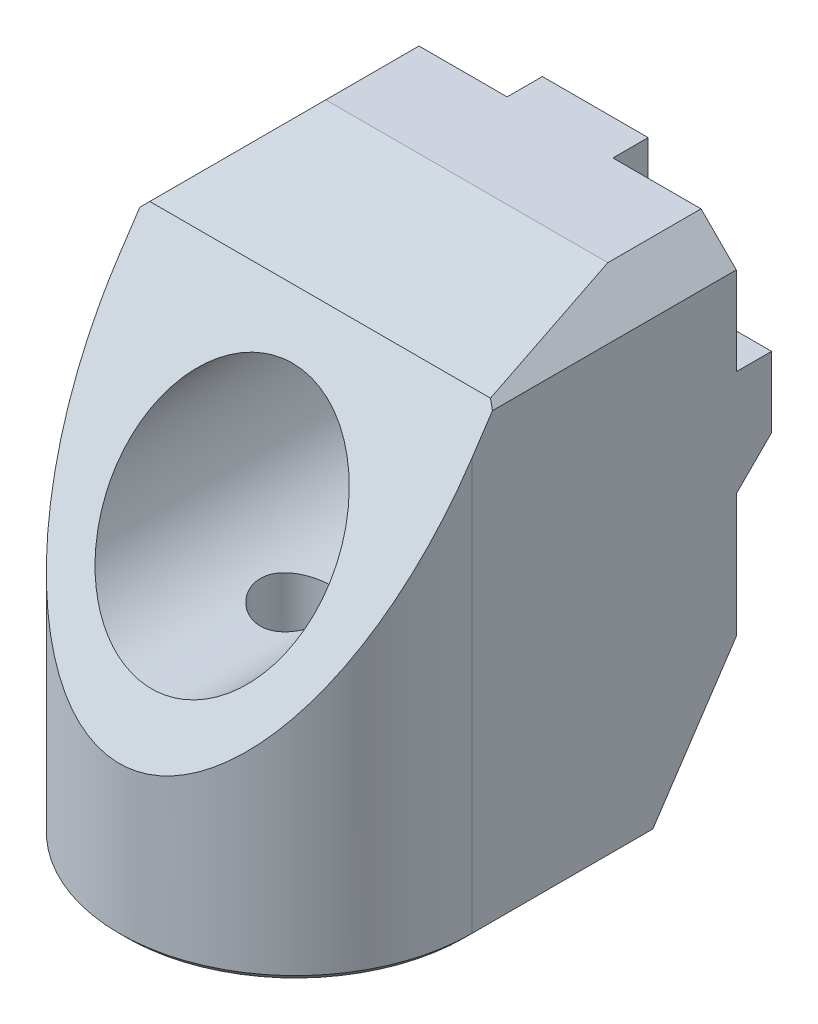
ISO-10303-21;
HEADER;
FILE_DESCRIPTION(('STEP AP214'),'2;1');
FILE_NAME('part.step','',(''),(''),'','','');
FILE_SCHEMA(('AUTOMOTIVE_DESIGN { 1 0 10303 214 1 1 1 1 }'));
ENDSEC;
DATA;
#1=APPLICATION_CONTEXT('core data for automotive mechanical design processes');
#2=APPLICATION_PROTOCOL_DEFINITION('international standard','automotive_design',2000,#1);
#3=PRODUCT_CONTEXT('',#1,'mechanical');
#4=PRODUCT('Part','Part','',(#3));
#5=PRODUCT_RELATED_PRODUCT_CATEGORY('part','',(#4));
#6=PRODUCT_DEFINITION_FORMATION('','',#4);
#7=PRODUCT_DEFINITION_CONTEXT('part definition',#1,'design');
#8=PRODUCT_DEFINITION('design','',#6,#7);
#9=PRODUCT_DEFINITION_SHAPE('','',#8);
#10=(LENGTH_UNIT() NAMED_UNIT(*) SI_UNIT(.MILLI.,.METRE.));
#11=(NAMED_UNIT(*) PLANE_ANGLE_UNIT() SI_UNIT($,.RADIAN.));
#12=(NAMED_UNIT(*) SI_UNIT($,.STERADIAN.) SOLID_ANGLE_UNIT());
#13=UNCERTAINTY_MEASURE_WITH_UNIT(LENGTH_MEASURE(1.E-05),#10,'distance_accuracy_value','');
#14=(GEOMETRIC_REPRESENTATION_CONTEXT(3) GLOBAL_UNCERTAINTY_ASSIGNED_CONTEXT((#13)) GLOBAL_UNIT_ASSIGNED_CONTEXT((#10,
#11,#12)) REPRESENTATION_CONTEXT('',''));
#15=CARTESIAN_POINT('',(0.,0.,0.));
#16=DIRECTION('',(0.,0.,1.));
#17=DIRECTION('',(1.,0.,0.));
#18=AXIS2_PLACEMENT_3D('',#15,#16,#17);
#19=CARTESIAN_POINT('',(0.,0.,0.));
#20=DIRECTION('',(0.,0.,1.));
#21=DIRECTION('',(1.,0.,0.));
#22=AXIS2_PLACEMENT_3D('',#19,#20,#21);
#23=PLANE('',#22);
#24=CARTESIAN_POINT('',(0.,0.,0.));
#25=DIRECTION('',(0.,0.,1.));
#26=DIRECTION('',(1.,0.,0.));
#27=AXIS2_PLACEMENT_3D('',#24,#25,#26);
#28=CIRCLE('',#27,2.75);
#29=CARTESIAN_POINT('',(2.75,0.,0.));
#30=VERTEX_POINT('',#29);
#31=EDGE_CURVE('E499',#30,#30,#28,.T.);
#32=ORIENTED_EDGE('',*,*,#31,.T.);
#33=EDGE_LOOP('',(#32));
#34=FACE_BOUND('',#33,.T.);
#35=DIRECTION('',(-1.,0.,0.));
#36=VECTOR('',#35,1.);
#37=CARTESIAN_POINT('',(10.,-3.00000000000022,0.));
#38=LINE('',#37,#36);
#39=CARTESIAN_POINT('',(10.,-3.00000000000022,0.));
#40=VERTEX_POINT('',#39);
#41=CARTESIAN_POINT('',(6.,-3.00000000000022,0.));
#42=VERTEX_POINT('',#41);
#43=EDGE_CURVE('E202',#40,#42,#38,.T.);
#44=ORIENTED_EDGE('',*,*,#43,.F.);
#45=DIRECTION('',(0.,1.,0.));
#46=VECTOR('',#45,1.);
#47=CARTESIAN_POINT('',(10.,10.,0.));
#48=LINE('',#47,#46);
#49=CARTESIAN_POINT('',(10.,-10.,0.));
#50=VERTEX_POINT('',#49);
#51=EDGE_CURVE('E493',#50,#40,#48,.T.);
#52=ORIENTED_EDGE('',*,*,#51,.F.);
#53=DIRECTION('',(1.,0.,0.));
#54=VECTOR('',#53,1.);
#55=CARTESIAN_POINT('',(-10.,-10.,0.));
#56=LINE('',#55,#54);
#57=CARTESIAN_POINT('',(-10.,-10.,0.));
#58=VERTEX_POINT('',#57);
#59=EDGE_CURVE('E507',#58,#50,#56,.T.);
#60=ORIENTED_EDGE('',*,*,#59,.F.);
#61=DIRECTION('',(0.,-1.,0.));
#62=VECTOR('',#61,1.);
#63=CARTESIAN_POINT('',(-10.,-10.,0.));
#64=LINE('',#63,#62);
#65=CARTESIAN_POINT('',(-10.,-3.00000000000001,0.));
#66=VERTEX_POINT('',#65);
#67=EDGE_CURVE('E498',#66,#58,#64,.T.);
#68=ORIENTED_EDGE('',*,*,#67,.F.);
#69=DIRECTION('',(-1.,0.,0.));
#70=VECTOR('',#69,1.);
#71=CARTESIAN_POINT('',(-10.0000000000002,-3.,0.));
#72=LINE('',#71,#70);
#73=CARTESIAN_POINT('',(-6.00000000000022,-3.,0.));
#74=VERTEX_POINT('',#73);
#75=EDGE_CURVE('E230',#74,#66,#72,.T.);
#76=ORIENTED_EDGE('',*,*,#75,.F.);
#77=DIRECTION('',(0.,-1.,0.));
#78=VECTOR('',#77,1.);
#79=CARTESIAN_POINT('',(-6.00000000000022,3.,0.));
#80=LINE('',#79,#78);
#81=CARTESIAN_POINT('',(-6.00000000000022,3.,0.));
#82=VERTEX_POINT('',#81);
#83=EDGE_CURVE('E233',#82,#74,#80,.T.);
#84=ORIENTED_EDGE('',*,*,#83,.F.);
#85=DIRECTION('',(1.,0.,0.));
#86=VECTOR('',#85,1.);
#87=CARTESIAN_POINT('',(-10.0000000000002,3.,0.));
#88=LINE('',#87,#86);
#89=CARTESIAN_POINT('',(-10.0000000000002,3.,0.));
#90=VERTEX_POINT('',#89);
#91=EDGE_CURVE('E236',#90,#82,#88,.T.);
#92=ORIENTED_EDGE('',*,*,#91,.F.);
#93=CARTESIAN_POINT('',(-10.,8.,0.));
#94=VERTEX_POINT('',#93);
#95=EDGE_CURVE('E495',#94,#90,#64,.T.);
#96=ORIENTED_EDGE('',*,*,#95,.F.);
#97=DIRECTION('',(-0.707106781186548,-0.707106781186547,0.));
#98=VECTOR('',#97,1.);
#99=CARTESIAN_POINT('',(-10.,8.,0.));
#100=LINE('',#99,#98);
#101=CARTESIAN_POINT('',(-8.00000000000001,10.,0.));
#102=VERTEX_POINT('',#101);
#103=EDGE_CURVE('E464',#94,#102,#100,.F.);
#104=ORIENTED_EDGE('',*,*,#103,.T.);
#105=DIRECTION('',(-1.,0.,0.));
#106=VECTOR('',#105,1.);
#107=CARTESIAN_POINT('',(-10.,10.,0.));
#108=LINE('',#107,#106);
#109=CARTESIAN_POINT('',(-3.,10.,0.));
#110=VERTEX_POINT('',#109);
#111=EDGE_CURVE('E492',#110,#102,#108,.T.);
#112=ORIENTED_EDGE('',*,*,#111,.F.);
#113=DIRECTION('',(0.,1.,0.));
#114=VECTOR('',#113,1.);
#115=CARTESIAN_POINT('',(-3.,10.,0.));
#116=LINE('',#115,#114);
#117=CARTESIAN_POINT('',(-3.,6.,0.));
#118=VERTEX_POINT('',#117);
#119=EDGE_CURVE('E248',#118,#110,#116,.T.);
#120=ORIENTED_EDGE('',*,*,#119,.F.);
#121=DIRECTION('',(-1.,0.,0.));
#122=VECTOR('',#121,1.);
#123=CARTESIAN_POINT('',(3.,6.,0.));
#124=LINE('',#123,#122);
#125=CARTESIAN_POINT('',(3.,6.,0.));
#126=VERTEX_POINT('',#125);
#127=EDGE_CURVE('E255',#126,#118,#124,.T.);
#128=ORIENTED_EDGE('',*,*,#127,.F.);
#129=DIRECTION('',(0.,-1.,0.));
#130=VECTOR('',#129,1.);
#131=CARTESIAN_POINT('',(3.,10.,0.));
#132=LINE('',#131,#130);
#133=CARTESIAN_POINT('',(3.,10.,0.));
#134=VERTEX_POINT('',#133);
#135=EDGE_CURVE('E238',#134,#126,#132,.T.);
#136=ORIENTED_EDGE('',*,*,#135,.F.);
#137=CARTESIAN_POINT('',(8.00000000000001,10.,0.));
#138=VERTEX_POINT('',#137);
#139=EDGE_CURVE('E489',#138,#134,#108,.T.);
#140=ORIENTED_EDGE('',*,*,#139,.F.);
#141=DIRECTION('',(-0.707106781186546,0.707106781186549,0.));
#142=VECTOR('',#141,1.);
#143=CARTESIAN_POINT('',(8.00000000000001,10.,0.));
#144=LINE('',#143,#142);
#145=CARTESIAN_POINT('',(10.,8.,0.));
#146=VERTEX_POINT('',#145);
#147=EDGE_CURVE('E462',#138,#146,#144,.F.);
#148=ORIENTED_EDGE('',*,*,#147,.T.);
#149=CARTESIAN_POINT('',(10.,2.99999999999978,0.));
#150=VERTEX_POINT('',#149);
#151=EDGE_CURVE('E214',#150,#146,#48,.T.);
#152=ORIENTED_EDGE('',*,*,#151,.F.);
#153=DIRECTION('',(1.,0.,0.));
#154=VECTOR('',#153,1.);
#155=CARTESIAN_POINT('',(10.,2.99999999999978,0.));
#156=LINE('',#155,#154);
#157=CARTESIAN_POINT('',(6.,2.99999999999978,0.));
#158=VERTEX_POINT('',#157);
#159=EDGE_CURVE('E203',#158,#150,#156,.T.);
#160=ORIENTED_EDGE('',*,*,#159,.F.);
#161=DIRECTION('',(0.,1.,0.));
#162=VECTOR('',#161,1.);
#163=CARTESIAN_POINT('',(6.,-3.00000000000022,0.));
#164=LINE('',#163,#162);
#165=EDGE_CURVE('E194',#42,#158,#164,.T.);
#166=ORIENTED_EDGE('',*,*,#165,.F.);
#167=EDGE_LOOP('',(#44,#52,#60,#68,#76,#84,#92,#96,#104,#112,#120,#128,#136,#140,#148,#152,#160,#166));
#168=FACE_BOUND('',#167,.T.);
#169=ADVANCED_FACE('F38',(#34,#168),#23,.F.);
#170=CARTESIAN_POINT('',(10.,10.,25.));
#171=DIRECTION('',(-1.,0.,0.));
#172=DIRECTION('',(0.,-1.,0.));
#173=AXIS2_PLACEMENT_3D('',#170,#171,#172);
#174=PLANE('',#173);
#175=ORIENTED_EDGE('',*,*,#51,.T.);
#176=DIRECTION('',(0.,-0.707106781186546,0.707106781186549));
#177=VECTOR('',#176,1.);
#178=CARTESIAN_POINT('',(10.,-1.00000000000022,-2.));
#179=LINE('',#178,#177);
#180=CARTESIAN_POINT('',(10.,-1.00000000000022,-2.));
#181=VERTEX_POINT('',#180);
#182=EDGE_CURVE('E11',#40,#181,#179,.F.);
#183=ORIENTED_EDGE('',*,*,#182,.T.);
#184=DIRECTION('',(0.,-1.,0.));
#185=VECTOR('',#184,1.);
#186=CARTESIAN_POINT('',(10.,-3.00000000000022,-2.));
#187=LINE('',#186,#185);
#188=CARTESIAN_POINT('',(10.,2.99999999999978,-2.));
#189=VERTEX_POINT('',#188);
#190=EDGE_CURVE('E215',#189,#181,#187,.T.);
#191=ORIENTED_EDGE('',*,*,#190,.F.);
#192=DIRECTION('',(0.,0.,1.));
#193=VECTOR('',#192,1.);
#194=CARTESIAN_POINT('',(10.,2.99999999999978,-2.));
#195=LINE('',#194,#193);
#196=EDGE_CURVE('E211',#189,#150,#195,.T.);
#197=ORIENTED_EDGE('',*,*,#196,.T.);
#198=ORIENTED_EDGE('',*,*,#151,.T.);
#199=DIRECTION('',(0.,0.,1.));
#200=VECTOR('',#199,1.);
#201=CARTESIAN_POINT('',(10.,8.,25.));
#202=LINE('',#201,#200);
#203=CARTESIAN_POINT('',(10.,8.,13.8333333333333));
#204=VERTEX_POINT('',#203);
#205=EDGE_CURVE('E460',#146,#204,#202,.T.);
#206=ORIENTED_EDGE('',*,*,#205,.T.);
#207=DIRECTION('',(0.,-0.832050294337844,0.554700196225229));
#208=VECTOR('',#207,1.);
#209=CARTESIAN_POINT('',(10.,4.23076923076923,16.3461538461538));
#210=LINE('',#209,#208);
#211=CARTESIAN_POINT('',(10.,6.25000000000001,15.));
#212=VERTEX_POINT('',#211);
#213=EDGE_CURVE('E501',#204,#212,#210,.T.);
#214=ORIENTED_EDGE('',*,*,#213,.T.);
#215=DIRECTION('',(0.,-1.,0.));
#216=VECTOR('',#215,1.);
#217=CARTESIAN_POINT('',(10.,10.001,15.));
#218=LINE('',#217,#216);
#219=CARTESIAN_POINT('',(10.,-17.1,15.));
#220=VERTEX_POINT('',#219);
#221=EDGE_CURVE('E272',#212,#220,#218,.T.);
#222=ORIENTED_EDGE('',*,*,#221,.T.);
#223=DIRECTION('',(0.,0.,-1.));
#224=VECTOR('',#223,1.);
#225=CARTESIAN_POINT('',(10.,-17.1,25.));
#226=LINE('',#225,#224);
#227=CARTESIAN_POINT('',(10.,-17.1,4.73333333333334));
#228=VERTEX_POINT('',#227);
#229=EDGE_CURVE('E452',#220,#228,#226,.T.);
#230=ORIENTED_EDGE('',*,*,#229,.T.);
#231=DIRECTION('',(0.,0.832050294337844,-0.554700196225229));
#232=VECTOR('',#231,1.);
#233=CARTESIAN_POINT('',(10.,-7.6923076923077,-1.53846153846153));
#234=LINE('',#233,#232);
#235=EDGE_CURVE('E480',#228,#50,#234,.T.);
#236=ORIENTED_EDGE('',*,*,#235,.T.);
#237=EDGE_LOOP('',(#175,#183,#191,#197,#198,#206,#214,#222,#230,#236));
#238=FACE_BOUND('',#237,.T.);
#239=ADVANCED_FACE('F334',(#238),#174,.F.);
#240=CARTESIAN_POINT('',(-10.,-10.,25.));
#241=DIRECTION('',(1.,0.,0.));
#242=DIRECTION('',(0.,1.,0.));
#243=AXIS2_PLACEMENT_3D('',#240,#241,#242);
#244=PLANE('',#243);
#245=DIRECTION('',(0.,1.,0.));
#246=VECTOR('',#245,1.);
#247=CARTESIAN_POINT('',(-10.0000000000002,3.,-2.));
#248=LINE('',#247,#246);
#249=CARTESIAN_POINT('',(-10.0000000000002,-1.,-2.));
#250=VERTEX_POINT('',#249);
#251=CARTESIAN_POINT('',(-10.0000000000002,3.,-2.));
#252=VERTEX_POINT('',#251);
#253=EDGE_CURVE('E234',#250,#252,#248,.T.);
#254=ORIENTED_EDGE('',*,*,#253,.F.);
#255=DIRECTION('',(0.,0.707106781186547,-0.707106781186548));
#256=VECTOR('',#255,1.);
#257=CARTESIAN_POINT('',(-10.,-1.,-2.));
#258=LINE('',#257,#256);
#259=EDGE_CURVE('E427',#250,#66,#258,.F.);
#260=ORIENTED_EDGE('',*,*,#259,.T.);
#261=ORIENTED_EDGE('',*,*,#67,.T.);
#262=DIRECTION('',(0.,-0.832050294337843,0.554700196225229));
#263=VECTOR('',#262,1.);
#264=CARTESIAN_POINT('',(-10.,-17.5,5.));
#265=LINE('',#264,#263);
#266=CARTESIAN_POINT('',(-10.,-17.1,4.73333333333333));
#267=VERTEX_POINT('',#266);
#268=EDGE_CURVE('E504',#58,#267,#265,.T.);
#269=ORIENTED_EDGE('',*,*,#268,.T.);
#270=DIRECTION('',(0.,0.,1.));
#271=VECTOR('',#270,1.);
#272=CARTESIAN_POINT('',(-10.,-17.1,25.));
#273=LINE('',#272,#271);
#274=CARTESIAN_POINT('',(-10.,-17.1,15.));
#275=VERTEX_POINT('',#274);
#276=EDGE_CURVE('E432',#267,#275,#273,.T.);
#277=ORIENTED_EDGE('',*,*,#276,.T.);
#278=DIRECTION('',(0.,-1.,0.));
#279=VECTOR('',#278,1.);
#280=CARTESIAN_POINT('',(-10.,10.001,15.));
#281=LINE('',#280,#279);
#282=CARTESIAN_POINT('',(-10.,6.24999999999999,15.));
#283=VERTEX_POINT('',#282);
#284=EDGE_CURVE('E266',#283,#275,#281,.T.);
#285=ORIENTED_EDGE('',*,*,#284,.F.);
#286=DIRECTION('',(0.,0.832050294337844,-0.554700196225229));
#287=VECTOR('',#286,1.);
#288=CARTESIAN_POINT('',(-10.,9.99999999999999,12.5));
#289=LINE('',#288,#287);
#290=CARTESIAN_POINT('',(-10.,8.,13.8333333333333));
#291=VERTEX_POINT('',#290);
#292=EDGE_CURVE('E503',#283,#291,#289,.T.);
#293=ORIENTED_EDGE('',*,*,#292,.T.);
#294=DIRECTION('',(0.,0.,-1.));
#295=VECTOR('',#294,1.);
#296=CARTESIAN_POINT('',(-10.,8.,25.));
#297=LINE('',#296,#295);
#298=EDGE_CURVE('E455',#291,#94,#297,.T.);
#299=ORIENTED_EDGE('',*,*,#298,.T.);
#300=ORIENTED_EDGE('',*,*,#95,.T.);
#301=DIRECTION('',(0.,0.,1.));
#302=VECTOR('',#301,1.);
#303=CARTESIAN_POINT('',(-10.0000000000002,3.,-2.));
#304=LINE('',#303,#302);
#305=EDGE_CURVE('E222',#252,#90,#304,.T.);
#306=ORIENTED_EDGE('',*,*,#305,.F.);
#307=EDGE_LOOP('',(#254,#260,#261,#269,#277,#285,#293,#299,#300,#306));
#308=FACE_BOUND('',#307,.T.);
#309=ADVANCED_FACE('F340',(#308),#244,.F.);
#310=CARTESIAN_POINT('',(-10.,-17.5,25.));
#311=DIRECTION('',(0.,1.,0.));
#312=DIRECTION('',(0.,0.,1.));
#313=AXIS2_PLACEMENT_3D('',#310,#311,#312);
#314=PLANE('',#313);
#315=CARTESIAN_POINT('',(0.,-17.5,15.));
#316=DIRECTION('',(0.,-1.,0.));
#317=DIRECTION('',(0.,0.,-1.));
#318=AXIS2_PLACEMENT_3D('',#315,#316,#317);
#319=CIRCLE('',#318,2.);
#320=CARTESIAN_POINT('',(0.,-17.5,13.));
#321=VERTEX_POINT('',#320);
#322=EDGE_CURVE('E275',#321,#321,#319,.T.);
#323=ORIENTED_EDGE('',*,*,#322,.F.);
#324=EDGE_LOOP('',(#323));
#325=FACE_BOUND('',#324,.T.);
#326=DIRECTION('',(1.,0.,0.));
#327=VECTOR('',#326,1.);
#328=CARTESIAN_POINT('',(-10.,-17.5,5.));
#329=LINE('',#328,#327);
#330=CARTESIAN_POINT('',(-9.6,-17.5,5.));
#331=VERTEX_POINT('',#330);
#332=CARTESIAN_POINT('',(9.6,-17.5,5.));
#333=VERTEX_POINT('',#332);
#334=EDGE_CURVE('E484',#331,#333,#329,.T.);
#335=ORIENTED_EDGE('',*,*,#334,.T.);
#336=DIRECTION('',(0.,0.,1.));
#337=VECTOR('',#336,1.);
#338=CARTESIAN_POINT('',(9.60000000000001,-17.5,25.));
#339=LINE('',#338,#337);
#340=CARTESIAN_POINT('',(9.60000000000001,-17.5,15.));
#341=VERTEX_POINT('',#340);
#342=EDGE_CURVE('E442',#333,#341,#339,.T.);
#343=ORIENTED_EDGE('',*,*,#342,.T.);
#344=CARTESIAN_POINT('',(0.,-17.5,15.));
#345=DIRECTION('',(0.,1.,0.));
#346=DIRECTION('',(0.,0.,1.));
#347=AXIS2_PLACEMENT_3D('',#344,#345,#346);
#348=CIRCLE('',#347,9.60000000000001);
#349=CARTESIAN_POINT('',(-9.6,-17.5,15.));
#350=VERTEX_POINT('',#349);
#351=EDGE_CURVE('E444',#341,#350,#348,.F.);
#352=ORIENTED_EDGE('',*,*,#351,.T.);
#353=DIRECTION('',(0.,0.,-1.));
#354=VECTOR('',#353,1.);
#355=CARTESIAN_POINT('',(-9.6,-17.5,25.));
#356=LINE('',#355,#354);
#357=EDGE_CURVE('E446',#350,#331,#356,.T.);
#358=ORIENTED_EDGE('',*,*,#357,.T.);
#359=EDGE_LOOP('',(#335,#343,#352,#358));
#360=FACE_BOUND('',#359,.T.);
#361=ADVANCED_FACE('F349',(#325,#360),#314,.F.);
#362=CARTESIAN_POINT('',(-10.,10.,25.));
#363=DIRECTION('',(0.,-1.,0.));
#364=DIRECTION('',(0.,0.,-1.));
#365=AXIS2_PLACEMENT_3D('',#362,#363,#364);
#366=PLANE('',#365);
#367=DIRECTION('',(1.,0.,0.));
#368=VECTOR('',#367,1.);
#369=CARTESIAN_POINT('',(-10.,10.,5.28889744907208));
#370=LINE('',#369,#368);
#371=CARTESIAN_POINT('',(-8.00000000000001,10.,5.28889744907208));
#372=VERTEX_POINT('',#371);
#373=CARTESIAN_POINT('',(8.00000000000001,10.,5.28889744907208));
#374=VERTEX_POINT('',#373);
#375=EDGE_CURVE('E475',#372,#374,#370,.T.);
#376=ORIENTED_EDGE('',*,*,#375,.T.);
#377=DIRECTION('',(0.,0.,-1.));
#378=VECTOR('',#377,1.);
#379=CARTESIAN_POINT('',(8.00000000000001,10.,25.));
#380=LINE('',#379,#378);
#381=EDGE_CURVE('E473',#374,#138,#380,.T.);
#382=ORIENTED_EDGE('',*,*,#381,.T.);
#383=ORIENTED_EDGE('',*,*,#139,.T.);
#384=DIRECTION('',(0.,0.,1.));
#385=VECTOR('',#384,1.);
#386=CARTESIAN_POINT('',(3.,10.,-2.));
#387=LINE('',#386,#385);
#388=CARTESIAN_POINT('',(3.,10.,-2.));
#389=VERTEX_POINT('',#388);
#390=EDGE_CURVE('E252',#389,#134,#387,.T.);
#391=ORIENTED_EDGE('',*,*,#390,.F.);
#392=DIRECTION('',(1.,0.,0.));
#393=VECTOR('',#392,1.);
#394=CARTESIAN_POINT('',(3.,10.,-2.));
#395=LINE('',#394,#393);
#396=CARTESIAN_POINT('',(-3.,10.,-2.));
#397=VERTEX_POINT('',#396);
#398=EDGE_CURVE('E250',#397,#389,#395,.T.);
#399=ORIENTED_EDGE('',*,*,#398,.F.);
#400=DIRECTION('',(0.,0.,1.));
#401=VECTOR('',#400,1.);
#402=CARTESIAN_POINT('',(-3.,10.,-2.));
#403=LINE('',#402,#401);
#404=EDGE_CURVE('E262',#397,#110,#403,.T.);
#405=ORIENTED_EDGE('',*,*,#404,.T.);
#406=ORIENTED_EDGE('',*,*,#111,.T.);
#407=DIRECTION('',(0.,0.,1.));
#408=VECTOR('',#407,1.);
#409=CARTESIAN_POINT('',(-8.00000000000001,10.,25.));
#410=LINE('',#409,#408);
#411=EDGE_CURVE('E478',#102,#372,#410,.T.);
#412=ORIENTED_EDGE('',*,*,#411,.T.);
#413=EDGE_LOOP('',(#376,#382,#383,#391,#399,#405,#406,#412));
#414=FACE_BOUND('',#413,.T.);
#415=ADVANCED_FACE('F347',(#414),#366,.F.);
#416=CARTESIAN_POINT('',(0.,0.,25.));
#417=DIRECTION('',(0.,0.,-1.));
#418=DIRECTION('',(-1.,0.,0.));
#419=AXIS2_PLACEMENT_3D('',#416,#417,#418);
#420=CYLINDRICAL_SURFACE('',#419,2.75);
#421=CARTESIAN_POINT('',(0.,0.,5.));
#422=DIRECTION('',(0.,0.,-1.));
#423=DIRECTION('',(-1.,0.,0.));
#424=AXIS2_PLACEMENT_3D('',#421,#422,#423);
#425=CIRCLE('',#424,2.75);
#426=CARTESIAN_POINT('',(-2.75,0.,5.));
#427=VERTEX_POINT('',#426);
#428=EDGE_CURVE('E481',#427,#427,#425,.T.);
#429=ORIENTED_EDGE('',*,*,#428,.F.);
#430=EDGE_LOOP('',(#429));
#431=FACE_BOUND('',#430,.T.);
#432=ORIENTED_EDGE('',*,*,#31,.F.);
#433=EDGE_LOOP('',(#432));
#434=FACE_BOUND('',#433,.T.);
#435=ADVANCED_FACE('F345',(#431,#434),#420,.F.);
#436=CARTESIAN_POINT('',(-10.,9.99999999999999,12.5));
#437=DIRECTION('',(0.,-0.554700196225229,-0.832050294337844));
#438=DIRECTION('',(0.,0.832050294337844,-0.554700196225229));
#439=AXIS2_PLACEMENT_3D('',#436,#437,#438);
#440=PLANE('',#439);
#441=CARTESIAN_POINT('',(0.,0.,19.1666666666667));
#442=DIRECTION('',(0.,-0.554700196225229,-0.832050294337844));
#443=DIRECTION('',(0.,0.832050294337844,-0.554700196225229));
#444=AXIS2_PLACEMENT_3D('',#441,#442,#443);
#445=ELLIPSE('',#444,7.21110255092798,6.);
#446=CARTESIAN_POINT('',(0.,6.,15.1666666666667));
#447=VERTEX_POINT('',#446);
#448=EDGE_CURVE('E485',#447,#447,#445,.T.);
#449=ORIENTED_EDGE('',*,*,#448,.T.);
#450=EDGE_LOOP('',(#449));
#451=FACE_BOUND('',#450,.T.);
#452=ORIENTED_EDGE('',*,*,#213,.F.);
#453=DIRECTION('',(0.63960214906683,-0.639602149066832,0.426401432711221));
#454=VECTOR('',#453,1.);
#455=CARTESIAN_POINT('',(11.4090909090909,6.59090909090908,14.7727272727273));
#456=LINE('',#455,#454);
#457=CARTESIAN_POINT('',(9.66410058867569,8.33589941132431,13.6094003924505));
#458=VERTEX_POINT('',#457);
#459=EDGE_CURVE('E467',#204,#458,#456,.F.);
#460=ORIENTED_EDGE('',*,*,#459,.T.);
#461=DIRECTION('',(-1.,0.,0.));
#462=VECTOR('',#461,1.);
#463=CARTESIAN_POINT('',(-10.,8.33589941132431,13.6094003924505));
#464=LINE('',#463,#462);
#465=CARTESIAN_POINT('',(-9.6641005886757,8.33589941132431,13.6094003924505));
#466=VERTEX_POINT('',#465);
#467=EDGE_CURVE('E469',#458,#466,#464,.T.);
#468=ORIENTED_EDGE('',*,*,#467,.T.);
#469=DIRECTION('',(0.639602149066832,0.639602149066831,-0.42640143271122));
#470=VECTOR('',#469,1.);
#471=CARTESIAN_POINT('',(-13.0454545454546,4.95454545454546,15.8636363636364));
#472=LINE('',#471,#470);
#473=EDGE_CURVE('E471',#466,#291,#472,.F.);
#474=ORIENTED_EDGE('',*,*,#473,.T.);
#475=ORIENTED_EDGE('',*,*,#292,.F.);
#476=CARTESIAN_POINT('',(0.,6.25,15.));
#477=DIRECTION('',(0.,-0.554700196225229,-0.832050294337844));
#478=DIRECTION('',(0.,-0.832050294337844,0.554700196225229));
#479=AXIS2_PLACEMENT_3D('',#476,#477,#478);
#480=ELLIPSE('',#479,18.02775637732,10.);
#481=EDGE_CURVE('E269',#212,#283,#480,.T.);
#482=ORIENTED_EDGE('',*,*,#481,.F.);
#483=EDGE_LOOP('',(#452,#460,#468,#474,#475,#482));
#484=FACE_BOUND('',#483,.T.);
#485=ADVANCED_FACE('F553',(#451,#484),#440,.F.);
#486=CARTESIAN_POINT('',(-10.,-17.5,5.));
#487=DIRECTION('',(0.,0.554700196225229,0.832050294337844));
#488=DIRECTION('',(0.,-0.832050294337844,0.554700196225229));
#489=AXIS2_PLACEMENT_3D('',#486,#487,#488);
#490=PLANE('',#489);
#491=ORIENTED_EDGE('',*,*,#235,.F.);
#492=DIRECTION('',(0.639602149066826,0.639602149066835,-0.426401432711223));
#493=VECTOR('',#492,1.);
#494=CARTESIAN_POINT('',(4.47272727272729,-22.6272727272728,8.41818181818186));
#495=LINE('',#494,#493);
#496=EDGE_CURVE('E448',#228,#333,#495,.F.);
#497=ORIENTED_EDGE('',*,*,#496,.T.);
#498=ORIENTED_EDGE('',*,*,#334,.F.);
#499=DIRECTION('',(0.639602149066828,-0.639602149066833,0.426401432711222));
#500=VECTOR('',#499,1.);
#501=CARTESIAN_POINT('',(-4.14545454545455,-22.9545454545455,8.63636363636366));
#502=LINE('',#501,#500);
#503=EDGE_CURVE('E450',#331,#267,#502,.F.);
#504=ORIENTED_EDGE('',*,*,#503,.T.);
#505=ORIENTED_EDGE('',*,*,#268,.F.);
#506=ORIENTED_EDGE('',*,*,#59,.T.);
#507=EDGE_LOOP('',(#491,#497,#498,#504,#505,#506));
#508=FACE_BOUND('',#507,.T.);
#509=ADVANCED_FACE('F539',(#508),#490,.F.);
#510=CARTESIAN_POINT('',(0.,0.,25.));
#511=DIRECTION('',(0.,0.,-1.));
#512=DIRECTION('',(-1.,0.,0.));
#513=AXIS2_PLACEMENT_3D('',#510,#511,#512);
#514=CYLINDRICAL_SURFACE('',#513,6.);
#515=CARTESIAN_POINT('',(0.,-6.,13.));
#516=CARTESIAN_POINT('',(-0.109126725773445,-6.00000030601888,12.9999994925367));
#517=CARTESIAN_POINT('',(-0.218250389077099,-5.9969953901509,13.0089605322544));
#518=CARTESIAN_POINT('',(-0.433283521745943,-5.98530420406562,13.0444582176344));
#519=CARTESIAN_POINT('',(-0.539192656237634,-5.97661734404305,13.0709966878978));
#520=CARTESIAN_POINT('',(-0.744665579003551,-5.95450615812885,13.1406384867681));
#521=CARTESIAN_POINT('',(-0.844239651772067,-5.94108975461707,13.1837141249185));
#522=CARTESIAN_POINT('',(-1.03474987361065,-5.91088891434684,13.2850823456767));
#523=CARTESIAN_POINT('',(-1.12568431391741,-5.89410381335556,13.3433779300052));
#524=CARTESIAN_POINT('',(-1.29948335004453,-5.8582818888601,13.4756516097175));
#525=CARTESIAN_POINT('',(-1.38200740059662,-5.8391911292757,13.550062468521));
#526=CARTESIAN_POINT('',(-1.53366538540417,-5.80120629566243,13.7115343094131));
#527=CARTESIAN_POINT('',(-1.60279637097892,-5.78231226581098,13.798598069857));
#528=CARTESIAN_POINT('',(-1.72764988445572,-5.74626664954548,13.9859702303929));
#529=CARTESIAN_POINT('',(-1.78292971644206,-5.72918078551376,14.0865874794642));
#530=CARTESIAN_POINT('',(-1.87563774775544,-5.69950610837202,14.2963521889171));
#531=CARTESIAN_POINT('',(-1.91307139477353,-5.68691592321491,14.4054970343255));
#532=CARTESIAN_POINT('',(-1.96774692301833,-5.66822606538755,14.6253464429934));
#533=CARTESIAN_POINT('',(-1.98562689654354,-5.66192191539223,14.7358744169781));
#534=CARTESIAN_POINT('',(-2.00268224666895,-5.65591313259015,14.9585275083118));
#535=CARTESIAN_POINT('',(-2.00186340320944,-5.6562064604546,15.0706521214184));
#536=CARTESIAN_POINT('',(-1.98203980740684,-5.6631803001636,15.287873260888));
#537=CARTESIAN_POINT('',(-1.96386782633399,-5.66956831735066,15.393056805838));
#538=CARTESIAN_POINT('',(-1.91121232569883,-5.68753315449102,15.5987868392137));
#539=CARTESIAN_POINT('',(-1.87672685318374,-5.69911059568215,15.6993327708701));
#540=CARTESIAN_POINT('',(-1.79187811612042,-5.72635822262498,15.894825499183));
#541=CARTESIAN_POINT('',(-1.74126809741452,-5.74209131586235,15.9896560509391));
#542=CARTESIAN_POINT('',(-1.62577821260628,-5.77585117151453,16.1697418165595));
#543=CARTESIAN_POINT('',(-1.56089422472801,-5.79387859580927,16.2549942538668));
#544=CARTESIAN_POINT('',(-1.41469866536447,-5.83134658335482,16.4181831963215));
#545=CARTESIAN_POINT('',(-1.33270630015262,-5.85081178709686,16.4955053890181));
#546=CARTESIAN_POINT('',(-1.15667913994013,-5.88813876774073,16.6354625333268));
#547=CARTESIAN_POINT('',(-1.06264319132163,-5.90600039076135,16.698096076329));
#548=CARTESIAN_POINT('',(-0.863895226092535,-5.93834215875587,16.8073926004701));
#549=CARTESIAN_POINT('',(-0.759086552832673,-5.95278700016078,16.8538909826815));
#550=CARTESIAN_POINT('',(-0.542538166729015,-5.9764113428887,16.9284063479114));
#551=CARTESIAN_POINT('',(-0.430800876309908,-5.98559267309759,16.9564297508469));
#552=CARTESIAN_POINT('',(-0.208767659058608,-5.99735254142881,16.9921113320447));
#553=CARTESIAN_POINT('',(-0.0986191997296922,-6.00020003667456,17.0005996183455));
#554=CARTESIAN_POINT('',(0.121550139920475,-5.99977805389655,16.9993346528031));
#555=CARTESIAN_POINT('',(0.231571038639302,-5.99650960838725,16.9895844800402));
#556=CARTESIAN_POINT('',(0.445039732608512,-5.98440049434209,16.9527761845281));
#557=CARTESIAN_POINT('',(0.548585613669687,-5.97572397422385,16.926227587901));
#558=CARTESIAN_POINT('',(0.749711917159147,-5.9538369366014,16.8572131110665));
#559=CARTESIAN_POINT('',(0.847291577017214,-5.9406258409335,16.8147452010644));
#560=CARTESIAN_POINT('',(1.03657659278655,-5.91057862574579,16.7138591363184));
#561=CARTESIAN_POINT('',(1.12805991843429,-5.89365629511572,16.6550508134337));
#562=CARTESIAN_POINT('',(1.30012966027117,-5.85810507832525,16.523611699973));
#563=CARTESIAN_POINT('',(1.38071273559115,-5.83947567187655,16.4509766879365));
#564=CARTESIAN_POINT('',(1.5325050156126,-5.8015369596089,16.2900424979868));
#565=CARTESIAN_POINT('',(1.60312193849154,-5.78223522174856,16.2011815461463));
#566=CARTESIAN_POINT('',(1.72851504464715,-5.74599946589417,16.0124568643782));
#567=CARTESIAN_POINT('',(1.78329109586203,-5.72906546764005,15.9125930427318));
#568=CARTESIAN_POINT('',(1.87519386083272,-5.69964783582767,15.7046539694202));
#569=CARTESIAN_POINT('',(1.91235626433004,-5.68715521585958,15.5965958416625));
#570=CARTESIAN_POINT('',(1.96778933351871,-5.66821664612899,15.3752426999117));
#571=CARTESIAN_POINT('',(1.98606850990788,-5.66176797247279,15.2619500691913));
#572=CARTESIAN_POINT('',(2.00255256495469,-5.65595717748354,15.0396058079182));
#573=CARTESIAN_POINT('',(2.0017405146168,-5.6562480051483,14.9306353194264));
#574=CARTESIAN_POINT('',(1.98248458689739,-5.66302539647735,14.7144698501559));
#575=CARTESIAN_POINT('',(1.96404175891717,-5.66951159138723,14.6072747640898));
#576=CARTESIAN_POINT('',(1.91074362625869,-5.68769048609783,14.3997286739951));
#577=CARTESIAN_POINT('',(1.87620669203103,-5.69928196044955,14.299286349991));
#578=CARTESIAN_POINT('',(1.79195873151949,-5.72632797636937,14.1055451861235));
#579=CARTESIAN_POINT('',(1.74224433710761,-5.74178337526786,14.012247937624));
#580=CARTESIAN_POINT('',(1.62652138516686,-5.77565658452093,13.8310326601542));
#581=CARTESIAN_POINT('',(1.55989648552916,-5.79417423284274,13.7435269962032));
#582=CARTESIAN_POINT('',(1.4132857662713,-5.83166712566506,13.5806203732316));
#583=CARTESIAN_POINT('',(1.33329616890296,-5.85064249824745,13.5052228486239));
#584=CARTESIAN_POINT('',(1.15848311384138,-5.88780061051088,13.3657111754216));
#585=CARTESIAN_POINT('',(1.06320302699946,-5.90592363602513,13.302151304498));
#586=CARTESIAN_POINT('',(0.862714714813253,-5.93851982345224,13.1920191422987));
#587=CARTESIAN_POINT('',(0.7575090362647,-5.9529939181586,13.1454425081559));
#588=CARTESIAN_POINT('',(0.544987294401954,-5.97611030137084,13.0725567350227));
#589=CARTESIAN_POINT('',(0.437975515352819,-5.98498424845045,13.0454350674732));
#590=CARTESIAN_POINT('',(0.220640832020496,-5.99692814128444,13.0091594386457));
#591=CARTESIAN_POINT('',(0.110318851137494,-5.9999996906381,13.0000005130069));
#592=CARTESIAN_POINT('',(0.,-6.,13.));
#593=B_SPLINE_CURVE_WITH_KNOTS('',3,(#515,#516,#517,#518,#519,#520,#521,#522,#523,#524,#525,
#526,#527,#528,#529,#530,#531,#532,#533,#534,#535,#536,#537,#538,#539,#540,#541,#542,#543,#544,
#545,#546,#547,#548,#549,#550,#551,#552,#553,#554,#555,#556,#557,#558,#559,#560,#561,#562,#563,
#564,#565,#566,#567,#568,#569,#570,#571,#572,#573,#574,#575,#576,#577,#578,#579,#580,#581,#582,
#583,#584,#585,#586,#587,#588,#589,#590,#591,#592),.UNSPECIFIED.,.T.,.F.,(4,2,2,2,2,2,2,2,2,2,2,
2,2,2,2,2,2,2,2,2,2,2,2,2,2,2,2,2,2,2,2,2,2,2,2,2,2,2,4),(0.,0.326974212052022,
0.653982370535041,0.980445345740548,1.3069727555982,1.64369368565512,1.9804886657506,
2.32696769646941,2.67334089385667,3.0080385148368,3.34263267974971,3.6619365310256,
3.98127861710964,4.30576342310261,4.63034205116414,4.97186611622734,5.31342291933237,
5.65836811300715,6.00319337754416,6.33307166350339,6.66289426328353,6.98316315956427,
7.30347290568207,7.63220799687473,7.96104361643782,8.30482045761504,8.64860016469993,
8.99168027653541,9.3346056941168,9.65991332128517,9.98520158702751,10.3043117416084,
10.6234927635196,10.9566013338361,11.2898042224756,11.635993216702,11.9820936230491,
12.3127311674763,12.6432773207628),.UNSPECIFIED.);
#594=CARTESIAN_POINT('',(0.,-6.,13.));
#595=VERTEX_POINT('',#594);
#596=EDGE_CURVE('E278',#595,#595,#593,.T.);
#597=ORIENTED_EDGE('',*,*,#596,.F.);
#598=EDGE_LOOP('',(#597));
#599=FACE_BOUND('',#598,.T.);
#600=CARTESIAN_POINT('',(0.,0.,5.));
#601=DIRECTION('',(0.,0.,-1.));
#602=DIRECTION('',(-1.,0.,0.));
#603=AXIS2_PLACEMENT_3D('',#600,#601,#602);
#604=CIRCLE('',#603,6.);
#605=CARTESIAN_POINT('',(-6.,0.,5.));
#606=VERTEX_POINT('',#605);
#607=EDGE_CURVE('E286',#606,#606,#604,.T.);
#608=ORIENTED_EDGE('',*,*,#607,.T.);
#609=EDGE_LOOP('',(#608));
#610=FACE_BOUND('',#609,.T.);
#611=ORIENTED_EDGE('',*,*,#448,.F.);
#612=EDGE_LOOP('',(#611));
#613=FACE_BOUND('',#612,.T.);
#614=ADVANCED_FACE('F571',(#599,#610,#613),#514,.F.);
#615=CARTESIAN_POINT('',(0.,0.,5.));
#616=DIRECTION('',(0.,0.,-1.));
#617=DIRECTION('',(-1.,0.,0.));
#618=AXIS2_PLACEMENT_3D('',#615,#616,#617);
#619=PLANE('',#618);
#620=ORIENTED_EDGE('',*,*,#428,.T.);
#621=EDGE_LOOP('',(#620));
#622=FACE_BOUND('',#621,.T.);
#623=ORIENTED_EDGE('',*,*,#607,.F.);
#624=EDGE_LOOP('',(#623));
#625=FACE_BOUND('',#624,.T.);
#626=ADVANCED_FACE('F575',(#622,#625),#619,.F.);
#627=CARTESIAN_POINT('',(0.,10.001,15.));
#628=DIRECTION('',(0.,-1.,0.));
#629=DIRECTION('',(0.,0.,-1.));
#630=AXIS2_PLACEMENT_3D('',#627,#628,#629);
#631=CYLINDRICAL_SURFACE('',#630,2.);
#632=ORIENTED_EDGE('',*,*,#322,.T.);
#633=EDGE_LOOP('',(#632));
#634=FACE_BOUND('',#633,.T.);
#635=ORIENTED_EDGE('',*,*,#596,.T.);
#636=EDGE_LOOP('',(#635));
#637=FACE_BOUND('',#636,.T.);
#638=ADVANCED_FACE('F288',(#634,#637),#631,.F.);
#639=CARTESIAN_POINT('',(0.,10.001,15.));
#640=DIRECTION('',(0.,-1.,0.));
#641=DIRECTION('',(0.,0.,-1.));
#642=AXIS2_PLACEMENT_3D('',#639,#640,#641);
#643=CYLINDRICAL_SURFACE('',#642,10.);
#644=ORIENTED_EDGE('',*,*,#284,.T.);
#645=CARTESIAN_POINT('',(0.,-17.1,15.));
#646=DIRECTION('',(0.,1.,0.));
#647=DIRECTION('',(0.,0.,1.));
#648=AXIS2_PLACEMENT_3D('',#645,#646,#647);
#649=CIRCLE('',#648,10.);
#650=EDGE_CURVE('E440',#275,#220,#649,.T.);
#651=ORIENTED_EDGE('',*,*,#650,.T.);
#652=ORIENTED_EDGE('',*,*,#221,.F.);
#653=ORIENTED_EDGE('',*,*,#481,.T.);
#654=EDGE_LOOP('',(#644,#651,#652,#653));
#655=FACE_BOUND('',#654,.T.);
#656=ADVANCED_FACE('F293',(#655),#643,.T.);
#657=CARTESIAN_POINT('',(-10.,8.,25.));
#658=DIRECTION('',(0.707106781186547,-0.707106781186548,0.));
#659=DIRECTION('',(0.,0.,-1.));
#660=AXIS2_PLACEMENT_3D('',#657,#658,#659);
#661=PLANE('',#660);
#662=ORIENTED_EDGE('',*,*,#298,.F.);
#663=ORIENTED_EDGE('',*,*,#473,.F.);
#664=DIRECTION('',(0.192450089729877,0.192450089729877,-0.962250448649375));
#665=VECTOR('',#664,1.);
#666=CARTESIAN_POINT('',(-11.798352324246,6.20164767575405,24.2806590703016));
#667=LINE('',#666,#665);
#668=EDGE_CURVE('E270',#372,#466,#667,.F.);
#669=ORIENTED_EDGE('',*,*,#668,.F.);
#670=ORIENTED_EDGE('',*,*,#411,.F.);
#671=ORIENTED_EDGE('',*,*,#103,.F.);
#672=EDGE_LOOP('',(#662,#663,#669,#670,#671));
#673=FACE_BOUND('',#672,.T.);
#674=ADVANCED_FACE('F296',(#673),#661,.F.);
#675=CARTESIAN_POINT('',(8.00000000000001,10.,25.));
#676=DIRECTION('',(-0.707106781186549,-0.707106781186546,0.));
#677=DIRECTION('',(0.,0.,-1.));
#678=AXIS2_PLACEMENT_3D('',#675,#676,#677);
#679=PLANE('',#678);
#680=ORIENTED_EDGE('',*,*,#147,.F.);
#681=ORIENTED_EDGE('',*,*,#381,.F.);
#682=DIRECTION('',(0.192450089729876,-0.192450089729877,0.962250448649376));
#683=VECTOR('',#682,1.);
#684=CARTESIAN_POINT('',(11.6502041760978,6.3497958239022,23.5399183295609));
#685=LINE('',#684,#683);
#686=EDGE_CURVE('E436',#458,#374,#685,.F.);
#687=ORIENTED_EDGE('',*,*,#686,.F.);
#688=ORIENTED_EDGE('',*,*,#459,.F.);
#689=ORIENTED_EDGE('',*,*,#205,.F.);
#690=EDGE_LOOP('',(#680,#681,#687,#688,#689));
#691=FACE_BOUND('',#690,.T.);
#692=ADVANCED_FACE('F367',(#691),#679,.F.);
#693=CARTESIAN_POINT('',(-10.,10.,5.28889744907208));
#694=DIRECTION('',(0.,-0.98058067569092,-0.196116135138186));
#695=DIRECTION('',(1.,0.,0.));
#696=AXIS2_PLACEMENT_3D('',#693,#694,#695);
#697=PLANE('',#696);
#698=ORIENTED_EDGE('',*,*,#668,.T.);
#699=ORIENTED_EDGE('',*,*,#467,.F.);
#700=ORIENTED_EDGE('',*,*,#686,.T.);
#701=ORIENTED_EDGE('',*,*,#375,.F.);
#702=EDGE_LOOP('',(#698,#699,#700,#701));
#703=FACE_BOUND('',#702,.T.);
#704=ADVANCED_FACE('F359',(#703),#697,.F.);
#705=CARTESIAN_POINT('',(-9.6,-17.5,25.));
#706=DIRECTION('',(0.707106781186551,0.707106781186544,0.));
#707=DIRECTION('',(0.,0.,-1.));
#708=AXIS2_PLACEMENT_3D('',#705,#706,#707);
#709=PLANE('',#708);
#710=ORIENTED_EDGE('',*,*,#503,.F.);
#711=ORIENTED_EDGE('',*,*,#357,.F.);
#712=DIRECTION('',(0.707106781186544,-0.707106781186551,0.));
#713=VECTOR('',#712,1.);
#714=CARTESIAN_POINT('',(-10.,-17.1,15.));
#715=LINE('',#714,#713);
#716=EDGE_CURVE('E433',#275,#350,#715,.T.);
#717=ORIENTED_EDGE('',*,*,#716,.F.);
#718=ORIENTED_EDGE('',*,*,#276,.F.);
#719=EDGE_LOOP('',(#710,#711,#717,#718));
#720=FACE_BOUND('',#719,.T.);
#721=ADVANCED_FACE('F366',(#720),#709,.F.);
#722=CARTESIAN_POINT('',(0.,-17.1,15.));
#723=DIRECTION('',(0.,1.,0.));
#724=DIRECTION('',(0.,0.,1.));
#725=AXIS2_PLACEMENT_3D('',#722,#723,#724);
#726=CONICAL_SURFACE('',#725,10.,0.785398163397444);
#727=ORIENTED_EDGE('',*,*,#716,.T.);
#728=ORIENTED_EDGE('',*,*,#351,.F.);
#729=DIRECTION('',(-0.707106781186544,-0.707106781186551,0.));
#730=VECTOR('',#729,1.);
#731=CARTESIAN_POINT('',(10.,-17.1,15.));
#732=LINE('',#731,#730);
#733=EDGE_CURVE('E265',#220,#341,#732,.T.);
#734=ORIENTED_EDGE('',*,*,#733,.F.);
#735=ORIENTED_EDGE('',*,*,#650,.F.);
#736=EDGE_LOOP('',(#727,#728,#734,#735));
#737=FACE_BOUND('',#736,.T.);
#738=ADVANCED_FACE('F387',(#737),#726,.T.);
#739=CARTESIAN_POINT('',(10.,-17.1,25.));
#740=DIRECTION('',(-0.707106781186552,0.707106781186543,0.));
#741=DIRECTION('',(0.,0.,-1.));
#742=AXIS2_PLACEMENT_3D('',#739,#740,#741);
#743=PLANE('',#742);
#744=ORIENTED_EDGE('',*,*,#733,.T.);
#745=ORIENTED_EDGE('',*,*,#342,.F.);
#746=ORIENTED_EDGE('',*,*,#496,.F.);
#747=ORIENTED_EDGE('',*,*,#229,.F.);
#748=EDGE_LOOP('',(#744,#745,#746,#747));
#749=FACE_BOUND('',#748,.T.);
#750=ADVANCED_FACE('F302',(#749),#743,.F.);
#751=CARTESIAN_POINT('',(3.,10.,-2.));
#752=DIRECTION('',(-1.,0.,0.));
#753=DIRECTION('',(0.,-1.,0.));
#754=AXIS2_PLACEMENT_3D('',#751,#752,#753);
#755=PLANE('',#754);
#756=ORIENTED_EDGE('',*,*,#135,.T.);
#757=DIRECTION('',(0.,0.707106781186546,-0.707106781186549));
#758=VECTOR('',#757,1.);
#759=CARTESIAN_POINT('',(3.,8.,-2.));
#760=LINE('',#759,#758);
#761=CARTESIAN_POINT('',(3.,8.,-2.));
#762=VERTEX_POINT('',#761);
#763=EDGE_CURVE('E414',#126,#762,#760,.T.);
#764=ORIENTED_EDGE('',*,*,#763,.T.);
#765=DIRECTION('',(0.,-1.,0.));
#766=VECTOR('',#765,1.);
#767=CARTESIAN_POINT('',(3.,10.,-2.));
#768=LINE('',#767,#766);
#769=EDGE_CURVE('E244',#389,#762,#768,.T.);
#770=ORIENTED_EDGE('',*,*,#769,.F.);
#771=ORIENTED_EDGE('',*,*,#390,.T.);
#772=EDGE_LOOP('',(#756,#764,#770,#771));
#773=FACE_BOUND('',#772,.T.);
#774=ADVANCED_FACE('F298',(#773),#755,.F.);
#775=CARTESIAN_POINT('',(-3.,10.,-2.));
#776=DIRECTION('',(1.,0.,0.));
#777=DIRECTION('',(0.,1.,0.));
#778=AXIS2_PLACEMENT_3D('',#775,#776,#777);
#779=PLANE('',#778);
#780=DIRECTION('',(0.,1.,0.));
#781=VECTOR('',#780,1.);
#782=CARTESIAN_POINT('',(-3.,10.,-2.));
#783=LINE('',#782,#781);
#784=CARTESIAN_POINT('',(-3.,8.,-2.));
#785=VERTEX_POINT('',#784);
#786=EDGE_CURVE('E247',#785,#397,#783,.T.);
#787=ORIENTED_EDGE('',*,*,#786,.F.);
#788=DIRECTION('',(0.,-0.707106781186546,0.707106781186549));
#789=VECTOR('',#788,1.);
#790=CARTESIAN_POINT('',(-3.,8.,-2.));
#791=LINE('',#790,#789);
#792=EDGE_CURVE('E419',#785,#118,#791,.T.);
#793=ORIENTED_EDGE('',*,*,#792,.T.);
#794=ORIENTED_EDGE('',*,*,#119,.T.);
#795=ORIENTED_EDGE('',*,*,#404,.F.);
#796=EDGE_LOOP('',(#787,#793,#794,#795));
#797=FACE_BOUND('',#796,.T.);
#798=ADVANCED_FACE('F301',(#797),#779,.F.);
#799=CARTESIAN_POINT('',(0.,0.,-2.));
#800=DIRECTION('',(0.,0.,-1.));
#801=DIRECTION('',(-1.,0.,0.));
#802=AXIS2_PLACEMENT_3D('',#799,#800,#801);
#803=PLANE('',#802);
#804=ORIENTED_EDGE('',*,*,#769,.T.);
#805=DIRECTION('',(-1.,0.,0.));
#806=VECTOR('',#805,1.);
#807=CARTESIAN_POINT('',(-3.,8.,-2.));
#808=LINE('',#807,#806);
#809=EDGE_CURVE('E416',#762,#785,#808,.T.);
#810=ORIENTED_EDGE('',*,*,#809,.T.);
#811=ORIENTED_EDGE('',*,*,#786,.T.);
#812=ORIENTED_EDGE('',*,*,#398,.T.);
#813=EDGE_LOOP('',(#804,#810,#811,#812));
#814=FACE_BOUND('',#813,.T.);
#815=ADVANCED_FACE('F306',(#814),#803,.T.);
#816=CARTESIAN_POINT('',(-10.0000000000002,3.,-2.));
#817=DIRECTION('',(0.,-1.,0.));
#818=DIRECTION('',(0.,0.,-1.));
#819=AXIS2_PLACEMENT_3D('',#816,#817,#818);
#820=PLANE('',#819);
#821=ORIENTED_EDGE('',*,*,#91,.T.);
#822=DIRECTION('',(0.,0.,1.));
#823=VECTOR('',#822,1.);
#824=CARTESIAN_POINT('',(-6.00000000000022,3.,-2.));
#825=LINE('',#824,#823);
#826=CARTESIAN_POINT('',(-6.00000000000022,3.,-2.));
#827=VERTEX_POINT('',#826);
#828=EDGE_CURVE('E226',#827,#82,#825,.T.);
#829=ORIENTED_EDGE('',*,*,#828,.F.);
#830=DIRECTION('',(1.,0.,0.));
#831=VECTOR('',#830,1.);
#832=CARTESIAN_POINT('',(-10.0000000000002,3.,-2.));
#833=LINE('',#832,#831);
#834=EDGE_CURVE('E241',#252,#827,#833,.T.);
#835=ORIENTED_EDGE('',*,*,#834,.F.);
#836=ORIENTED_EDGE('',*,*,#305,.T.);
#837=EDGE_LOOP('',(#821,#829,#835,#836));
#838=FACE_BOUND('',#837,.T.);
#839=ADVANCED_FACE('F310',(#838),#820,.F.);
#840=CARTESIAN_POINT('',(-6.00000000000022,3.,-2.));
#841=DIRECTION('',(-1.,0.,0.));
#842=DIRECTION('',(0.,0.,1.));
#843=AXIS2_PLACEMENT_3D('',#840,#841,#842);
#844=PLANE('',#843);
#845=ORIENTED_EDGE('',*,*,#83,.T.);
#846=DIRECTION('',(0.,-0.707106781186547,0.707106781186548));
#847=VECTOR('',#846,1.);
#848=CARTESIAN_POINT('',(-6.00000000000022,-1.,-2.));
#849=LINE('',#848,#847);
#850=CARTESIAN_POINT('',(-6.00000000000022,-1.,-2.));
#851=VERTEX_POINT('',#850);
#852=EDGE_CURVE('E425',#74,#851,#849,.F.);
#853=ORIENTED_EDGE('',*,*,#852,.T.);
#854=DIRECTION('',(0.,-1.,0.));
#855=VECTOR('',#854,1.);
#856=CARTESIAN_POINT('',(-6.00000000000022,3.,-2.));
#857=LINE('',#856,#855);
#858=EDGE_CURVE('E229',#827,#851,#857,.T.);
#859=ORIENTED_EDGE('',*,*,#858,.F.);
#860=ORIENTED_EDGE('',*,*,#828,.T.);
#861=EDGE_LOOP('',(#845,#853,#859,#860));
#862=FACE_BOUND('',#861,.T.);
#863=ADVANCED_FACE('F315',(#862),#844,.F.);
#864=CARTESIAN_POINT('',(0.,0.,-2.));
#865=DIRECTION('',(0.,0.,1.));
#866=DIRECTION('',(1.,0.,0.));
#867=AXIS2_PLACEMENT_3D('',#864,#865,#866);
#868=PLANE('',#867);
#869=ORIENTED_EDGE('',*,*,#858,.T.);
#870=DIRECTION('',(-1.,0.,0.));
#871=VECTOR('',#870,1.);
#872=CARTESIAN_POINT('',(0.,-1.,-2.));
#873=LINE('',#872,#871);
#874=EDGE_CURVE('E429',#851,#250,#873,.T.);
#875=ORIENTED_EDGE('',*,*,#874,.T.);
#876=ORIENTED_EDGE('',*,*,#253,.T.);
#877=ORIENTED_EDGE('',*,*,#834,.T.);
#878=EDGE_LOOP('',(#869,#875,#876,#877));
#879=FACE_BOUND('',#878,.T.);
#880=ADVANCED_FACE('F312',(#879),#868,.F.);
#881=CARTESIAN_POINT('',(6.,-3.00000000000022,-2.));
#882=DIRECTION('',(1.,0.,0.));
#883=DIRECTION('',(0.,1.,0.));
#884=AXIS2_PLACEMENT_3D('',#881,#882,#883);
#885=PLANE('',#884);
#886=DIRECTION('',(0.,1.,0.));
#887=VECTOR('',#886,1.);
#888=CARTESIAN_POINT('',(6.,-3.00000000000022,-2.));
#889=LINE('',#888,#887);
#890=CARTESIAN_POINT('',(6.,-1.00000000000022,-2.));
#891=VERTEX_POINT('',#890);
#892=CARTESIAN_POINT('',(6.,2.99999999999978,-2.));
#893=VERTEX_POINT('',#892);
#894=EDGE_CURVE('E217',#891,#893,#889,.T.);
#895=ORIENTED_EDGE('',*,*,#894,.F.);
#896=DIRECTION('',(0.,0.707106781186546,-0.707106781186549));
#897=VECTOR('',#896,1.);
#898=CARTESIAN_POINT('',(6.,-1.00000000000022,-2.));
#899=LINE('',#898,#897);
#900=EDGE_CURVE('E47',#891,#42,#899,.F.);
#901=ORIENTED_EDGE('',*,*,#900,.T.);
#902=ORIENTED_EDGE('',*,*,#165,.T.);
#903=DIRECTION('',(0.,0.,1.));
#904=VECTOR('',#903,1.);
#905=CARTESIAN_POINT('',(6.,2.99999999999978,-2.));
#906=LINE('',#905,#904);
#907=EDGE_CURVE('E198',#893,#158,#906,.T.);
#908=ORIENTED_EDGE('',*,*,#907,.F.);
#909=EDGE_LOOP('',(#895,#901,#902,#908));
#910=FACE_BOUND('',#909,.T.);
#911=ADVANCED_FACE('F197',(#910),#885,.F.);
#912=CARTESIAN_POINT('',(10.,2.99999999999978,-2.));
#913=DIRECTION('',(0.,-1.,0.));
#914=DIRECTION('',(1.,0.,0.));
#915=AXIS2_PLACEMENT_3D('',#912,#913,#914);
#916=PLANE('',#915);
#917=ORIENTED_EDGE('',*,*,#159,.T.);
#918=ORIENTED_EDGE('',*,*,#196,.F.);
#919=DIRECTION('',(1.,0.,0.));
#920=VECTOR('',#919,1.);
#921=CARTESIAN_POINT('',(10.,2.99999999999978,-2.));
#922=LINE('',#921,#920);
#923=EDGE_CURVE('E210',#893,#189,#922,.T.);
#924=ORIENTED_EDGE('',*,*,#923,.F.);
#925=ORIENTED_EDGE('',*,*,#907,.T.);
#926=EDGE_LOOP('',(#917,#918,#924,#925));
#927=FACE_BOUND('',#926,.T.);
#928=ADVANCED_FACE('F207',(#927),#916,.F.);
#929=CARTESIAN_POINT('',(0.,0.,-2.));
#930=DIRECTION('',(0.,0.,1.));
#931=DIRECTION('',(1.,0.,0.));
#932=AXIS2_PLACEMENT_3D('',#929,#930,#931);
#933=PLANE('',#932);
#934=ORIENTED_EDGE('',*,*,#190,.T.);
#935=DIRECTION('',(-1.,0.,0.));
#936=VECTOR('',#935,1.);
#937=CARTESIAN_POINT('',(0.,-1.00000000000022,-2.));
#938=LINE('',#937,#936);
#939=EDGE_CURVE('E418',#181,#891,#938,.T.);
#940=ORIENTED_EDGE('',*,*,#939,.T.);
#941=ORIENTED_EDGE('',*,*,#894,.T.);
#942=ORIENTED_EDGE('',*,*,#923,.T.);
#943=EDGE_LOOP('',(#934,#940,#941,#942));
#944=FACE_BOUND('',#943,.T.);
#945=ADVANCED_FACE('F323',(#944),#933,.F.);
#946=CARTESIAN_POINT('',(0.,-1.,-2.));
#947=DIRECTION('',(0.,0.707106781186548,0.707106781186547));
#948=DIRECTION('',(-1.,0.,0.));
#949=AXIS2_PLACEMENT_3D('',#946,#947,#948);
#950=PLANE('',#949);
#951=ORIENTED_EDGE('',*,*,#852,.F.);
#952=ORIENTED_EDGE('',*,*,#75,.T.);
#953=ORIENTED_EDGE('',*,*,#259,.F.);
#954=ORIENTED_EDGE('',*,*,#874,.F.);
#955=EDGE_LOOP('',(#951,#952,#953,#954));
#956=FACE_BOUND('',#955,.T.);
#957=ADVANCED_FACE('F326',(#956),#950,.F.);
#958=CARTESIAN_POINT('',(0.,8.,-2.));
#959=DIRECTION('',(0.,-0.707106781186549,-0.707106781186546));
#960=DIRECTION('',(1.,0.,0.));
#961=AXIS2_PLACEMENT_3D('',#958,#959,#960);
#962=PLANE('',#961);
#963=ORIENTED_EDGE('',*,*,#763,.F.);
#964=ORIENTED_EDGE('',*,*,#127,.T.);
#965=ORIENTED_EDGE('',*,*,#792,.F.);
#966=ORIENTED_EDGE('',*,*,#809,.F.);
#967=EDGE_LOOP('',(#963,#964,#965,#966));
#968=FACE_BOUND('',#967,.T.);
#969=ADVANCED_FACE('F403',(#968),#962,.T.);
#970=CARTESIAN_POINT('',(0.,-1.00000000000022,-2.));
#971=DIRECTION('',(0.,0.707106781186549,0.707106781186546));
#972=DIRECTION('',(-1.,0.,0.));
#973=AXIS2_PLACEMENT_3D('',#970,#971,#972);
#974=PLANE('',#973);
#975=ORIENTED_EDGE('',*,*,#182,.F.);
#976=ORIENTED_EDGE('',*,*,#43,.T.);
#977=ORIENTED_EDGE('',*,*,#900,.F.);
#978=ORIENTED_EDGE('',*,*,#939,.F.);
#979=EDGE_LOOP('',(#975,#976,#977,#978));
#980=FACE_BOUND('',#979,.T.);
#981=ADVANCED_FACE('F41',(#980),#974,.F.);
#982=CLOSED_SHELL('',(#169,#239,#309,#361,#415,#435,#485,#509,#614,#626,#638,#656,#674,#692,
#704,#721,#738,#750,#774,#798,#815,#839,#863,#880,#911,#928,#945,#957,#969,#981));
#983=MANIFOLD_SOLID_BREP('B2',#982);
#984=ADVANCED_BREP_SHAPE_REPRESENTATION('',(#18,#983),#14);
#985=SHAPE_DEFINITION_REPRESENTATION(#9,#984);
ENDSEC;
END-ISO-10303-21;
